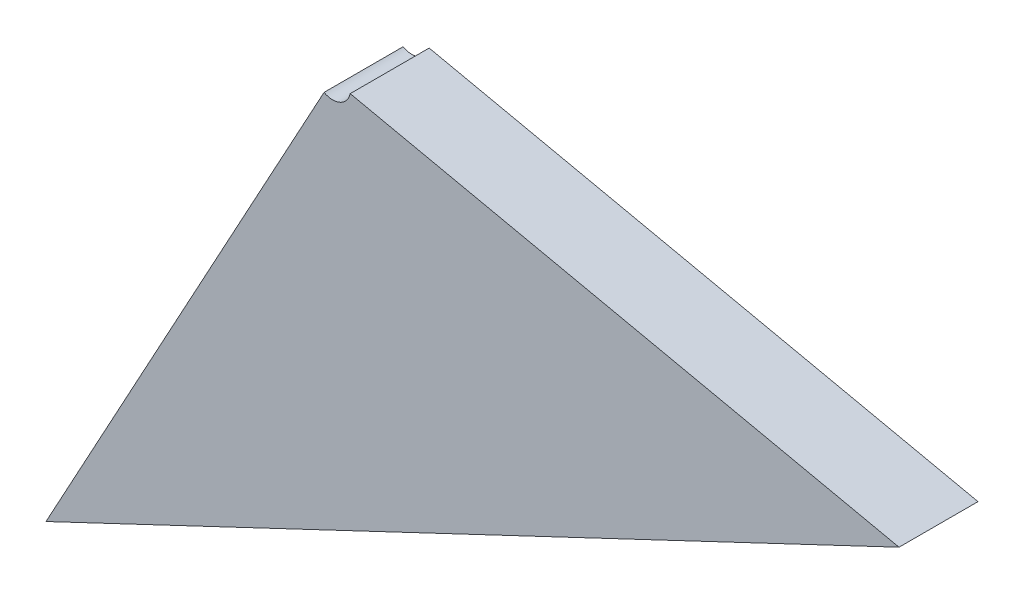
ISO-10303-21;
HEADER;
FILE_DESCRIPTION(('STEP AP214'),'2;1');
FILE_NAME('part.step','',(''),(''),'','','');
FILE_SCHEMA(('AUTOMOTIVE_DESIGN { 1 0 10303 214 1 1 1 1 }'));
ENDSEC;
DATA;
#1=APPLICATION_CONTEXT('core data for automotive mechanical design processes');
#2=APPLICATION_PROTOCOL_DEFINITION('international standard','automotive_design',2000,#1);
#3=PRODUCT_CONTEXT('',#1,'mechanical');
#4=PRODUCT('Part','Part','',(#3));
#5=PRODUCT_RELATED_PRODUCT_CATEGORY('part','',(#4));
#6=PRODUCT_DEFINITION_FORMATION('','',#4);
#7=PRODUCT_DEFINITION_CONTEXT('part definition',#1,'design');
#8=PRODUCT_DEFINITION('design','',#6,#7);
#9=PRODUCT_DEFINITION_SHAPE('','',#8);
#10=(LENGTH_UNIT() NAMED_UNIT(*) SI_UNIT(.MILLI.,.METRE.));
#11=(NAMED_UNIT(*) PLANE_ANGLE_UNIT() SI_UNIT($,.RADIAN.));
#12=(NAMED_UNIT(*) SI_UNIT($,.STERADIAN.) SOLID_ANGLE_UNIT());
#13=UNCERTAINTY_MEASURE_WITH_UNIT(LENGTH_MEASURE(1.E-05),#10,'distance_accuracy_value','');
#14=(GEOMETRIC_REPRESENTATION_CONTEXT(3) GLOBAL_UNCERTAINTY_ASSIGNED_CONTEXT((#13)) GLOBAL_UNIT_ASSIGNED_CONTEXT((#10,
#11,#12)) REPRESENTATION_CONTEXT('',''));
#15=CARTESIAN_POINT('',(0.,0.,0.));
#16=DIRECTION('',(0.,0.,1.));
#17=DIRECTION('',(1.,0.,0.));
#18=AXIS2_PLACEMENT_3D('',#15,#16,#17);
#19=CARTESIAN_POINT('',(-1.3508933358428,-1.3649345552813,0.00415));
#20=DIRECTION('',(0.,0.,1.));
#21=DIRECTION('',(1.,0.,0.));
#22=AXIS2_PLACEMENT_3D('',#19,#20,#21);
#23=PLANE('',#22);
#24=DIRECTION('',(0.903806397975915,0.427941578930819,0.));
#25=VECTOR('',#24,1.);
#26=CARTESIAN_POINT('',(-1.3668133220554,-1.3771889119476,0.00415));
#27=LINE('',#26,#25);
#28=CARTESIAN_POINT('',(-1.3671244011666,-1.3768596313854,0.00415));
#29=VERTEX_POINT('',#28);
#30=CARTESIAN_POINT('',(-1.331476194336,-1.359965635438,0.00415));
#31=VERTEX_POINT('',#30);
#32=EDGE_CURVE('E11',#29,#31,#27,.T.);
#33=ORIENTED_EDGE('',*,*,#32,.T.);
#34=DIRECTION('',(-0.977619939969144,0.210378832050014,0.));
#35=VECTOR('',#34,1.);
#36=CARTESIAN_POINT('',(-1.3314776618821,-1.3599529444789,0.00415));
#37=LINE('',#36,#35);
#38=CARTESIAN_POINT('',(-1.3544121881563,-1.3550175512306,0.00415));
#39=VERTEX_POINT('',#38);
#40=EDGE_CURVE('E24',#31,#39,#37,.T.);
#41=ORIENTED_EDGE('',*,*,#40,.T.);
#42=CARTESIAN_POINT('',(-1.3551454031113,-1.3548597671065,0.00415));
#43=DIRECTION('',(0.,0.,-1.));
#44=DIRECTION('',(0.478588394782336,0.878039377465309,0.));
#45=AXIS2_PLACEMENT_3D('',#42,#43,#44);
#46=CIRCLE('',#45,0.000749999999999999);
#47=CARTESIAN_POINT('',(-1.3555043444073,-1.3555182966396,0.00415));
#48=VERTEX_POINT('',#47);
#49=EDGE_CURVE('E130',#39,#48,#46,.T.);
#50=ORIENTED_EDGE('',*,*,#49,.T.);
#51=DIRECTION('',(-0.47858839478236,-0.878039377465296,0.));
#52=VECTOR('',#51,1.);
#53=CARTESIAN_POINT('',(-1.3555043444073,-1.3555182966396,0.00415));
#54=LINE('',#53,#52);
#55=EDGE_CURVE('E126',#48,#29,#54,.T.);
#56=ORIENTED_EDGE('',*,*,#55,.T.);
#57=EDGE_LOOP('',(#33,#41,#50,#56));
#58=FACE_BOUND('',#57,.T.);
#59=ADVANCED_FACE('F17',(#58),#23,.T.);
#60=CARTESIAN_POINT('',(-1.3551454031113,-1.3548597671065,0.00115));
#61=DIRECTION('',(0.,0.,1.));
#62=DIRECTION('',(-1.,0.,0.));
#63=AXIS2_PLACEMENT_3D('',#60,#61,#62);
#64=CYLINDRICAL_SURFACE('',#63,0.000749999999999999);
#65=DIRECTION('',(0.,0.,-1.));
#66=VECTOR('',#65,1.);
#67=CARTESIAN_POINT('',(-1.3555043444073,-1.3555182966396,0.00115));
#68=LINE('',#67,#66);
#69=CARTESIAN_POINT('',(-1.3555043444073,-1.3555182966396,0.00085));
#70=VERTEX_POINT('',#69);
#71=EDGE_CURVE('E74',#48,#70,#68,.T.);
#72=ORIENTED_EDGE('',*,*,#71,.F.);
#73=ORIENTED_EDGE('',*,*,#49,.F.);
#74=DIRECTION('',(0.,0.,1.));
#75=VECTOR('',#74,1.);
#76=CARTESIAN_POINT('',(-1.3544121881563,-1.3550175512306,0.00115));
#77=LINE('',#76,#75);
#78=CARTESIAN_POINT('',(-1.3544121881563,-1.3550175512306,0.00085));
#79=VERTEX_POINT('',#78);
#80=EDGE_CURVE('E122',#79,#39,#77,.T.);
#81=ORIENTED_EDGE('',*,*,#80,.F.);
#82=CARTESIAN_POINT('',(-1.3551454031113,-1.3548597671065,0.00085));
#83=DIRECTION('',(0.,0.,1.));
#84=DIRECTION('',(-1.,0.,0.));
#85=AXIS2_PLACEMENT_3D('',#82,#83,#84);
#86=CIRCLE('',#85,0.000749999999999999);
#87=EDGE_CURVE('E120',#70,#79,#86,.T.);
#88=ORIENTED_EDGE('',*,*,#87,.F.);
#89=EDGE_LOOP('',(#72,#73,#81,#88));
#90=FACE_BOUND('',#89,.T.);
#91=ADVANCED_FACE('F138',(#90),#64,.F.);
#92=CARTESIAN_POINT('',(-1.3551454031113,-1.3548597671065,0.00085));
#93=DIRECTION('',(-0.210378832050013,-0.977619939969144,0.));
#94=DIRECTION('',(0.977619939969144,-0.210378832050013,0.));
#95=AXIS2_PLACEMENT_3D('',#92,#93,#94);
#96=PLANE('',#95);
#97=ORIENTED_EDGE('',*,*,#80,.T.);
#98=ORIENTED_EDGE('',*,*,#40,.F.);
#99=CARTESIAN_POINT('',(-1.33147766188219,-1.35995294447888,0.00415));
#100=DIRECTION('',(0.,0.,-1.));
#101=VECTOR('',#100,1.);
#102=LINE('',#99,#101);
#103=CARTESIAN_POINT('',(-1.331476194336,-1.359965635438,0.00085));
#104=VERTEX_POINT('',#103);
#105=EDGE_CURVE('E109',#31,#104,#102,.T.);
#106=ORIENTED_EDGE('',*,*,#105,.T.);
#107=DIRECTION('',(0.977619939969144,-0.210378832050013,0.));
#108=VECTOR('',#107,1.);
#109=CARTESIAN_POINT('',(-1.3551454031113,-1.3548597671065,0.00085));
#110=LINE('',#109,#108);
#111=EDGE_CURVE('E60',#79,#104,#110,.T.);
#112=ORIENTED_EDGE('',*,*,#111,.F.);
#113=EDGE_LOOP('',(#97,#98,#106,#112));
#114=FACE_BOUND('',#113,.T.);
#115=ADVANCED_FACE('F92',(#114),#96,.F.);
#116=CARTESIAN_POINT('',(-1.3307444469272,-1.360110728603,0.00085));
#117=DIRECTION('',(-0.427941578930813,0.903806397975918,0.));
#118=DIRECTION('',(-0.903806397975918,-0.427941578930813,0.));
#119=AXIS2_PLACEMENT_3D('',#116,#117,#118);
#120=PLANE('',#119);
#121=ORIENTED_EDGE('',*,*,#105,.F.);
#122=ORIENTED_EDGE('',*,*,#32,.F.);
#123=CARTESIAN_POINT('',(-1.36713223555781,-1.3768513385986,0.00085));
#124=DIRECTION('',(0.,0.,1.));
#125=VECTOR('',#124,1.);
#126=LINE('',#123,#125);
#127=CARTESIAN_POINT('',(-1.3671244011666,-1.3768596313854,0.00085));
#128=VERTEX_POINT('',#127);
#129=EDGE_CURVE('E61',#128,#29,#126,.T.);
#130=ORIENTED_EDGE('',*,*,#129,.F.);
#131=DIRECTION('',(-0.903806397975917,-0.427941578930813,0.));
#132=VECTOR('',#131,1.);
#133=CARTESIAN_POINT('',(-1.3307444469272,-1.360110728603,0.00085));
#134=LINE('',#133,#132);
#135=EDGE_CURVE('E55',#104,#128,#134,.T.);
#136=ORIENTED_EDGE('',*,*,#135,.F.);
#137=EDGE_LOOP('',(#121,#122,#130,#136));
#138=FACE_BOUND('',#137,.T.);
#139=ADVANCED_FACE('F65',(#138),#120,.F.);
#140=CARTESIAN_POINT('',(-1.3674911768539,-1.3775098681317,0.00085));
#141=DIRECTION('',(0.878039377465294,-0.478588394782364,0.));
#142=DIRECTION('',(0.478588394782364,0.878039377465294,0.));
#143=AXIS2_PLACEMENT_3D('',#140,#141,#142);
#144=PLANE('',#143);
#145=ORIENTED_EDGE('',*,*,#71,.T.);
#146=DIRECTION('',(0.478588394782364,0.878039377465294,0.));
#147=VECTOR('',#146,1.);
#148=CARTESIAN_POINT('',(-1.3674911768539,-1.3775098681317,0.00085));
#149=LINE('',#148,#147);
#150=EDGE_CURVE('E58',#128,#70,#149,.T.);
#151=ORIENTED_EDGE('',*,*,#150,.F.);
#152=ORIENTED_EDGE('',*,*,#129,.T.);
#153=ORIENTED_EDGE('',*,*,#55,.F.);
#154=EDGE_LOOP('',(#145,#151,#152,#153));
#155=FACE_BOUND('',#154,.T.);
#156=ADVANCED_FACE('F72',(#155),#144,.F.);
#157=CARTESIAN_POINT('',(-1.3508752518886,-1.3649772146385,0.00085));
#158=DIRECTION('',(0.,0.,-1.));
#159=DIRECTION('',(-1.,0.,0.));
#160=AXIS2_PLACEMENT_3D('',#157,#158,#159);
#161=PLANE('',#160);
#162=ORIENTED_EDGE('',*,*,#150,.T.);
#163=ORIENTED_EDGE('',*,*,#87,.T.);
#164=ORIENTED_EDGE('',*,*,#111,.T.);
#165=ORIENTED_EDGE('',*,*,#135,.T.);
#166=EDGE_LOOP('',(#162,#163,#164,#165));
#167=FACE_BOUND('',#166,.T.);
#168=ADVANCED_FACE('F56',(#167),#161,.T.);
#169=CLOSED_SHELL('',(#59,#91,#115,#139,#156,#168));
#170=MANIFOLD_SOLID_BREP('B1',#169);
#171=ADVANCED_BREP_SHAPE_REPRESENTATION('',(#18,#170),#14);
#172=SHAPE_DEFINITION_REPRESENTATION(#9,#171);
ENDSEC;
END-ISO-10303-21;
